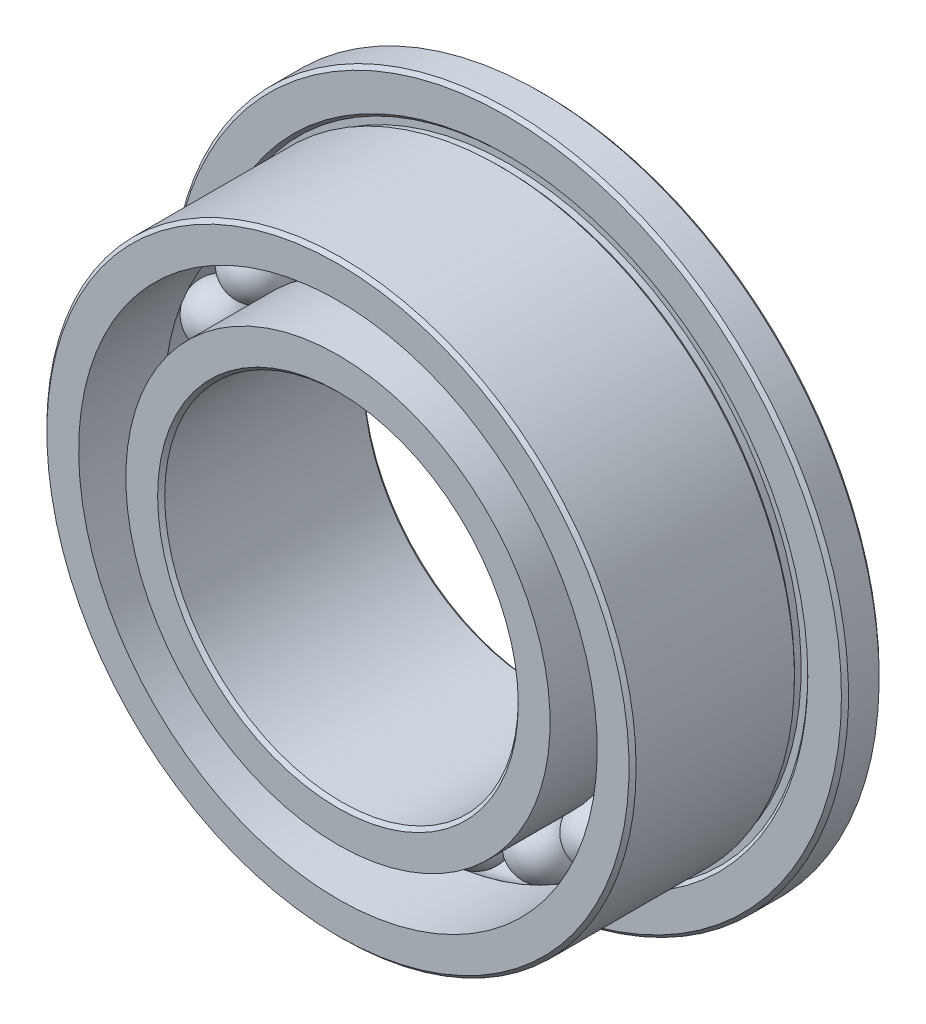
ISO-10303-21;
HEADER;
FILE_DESCRIPTION(('STEP AP214'),'2;1');
FILE_NAME('part.step','',(''),(''),'','','');
FILE_SCHEMA(('AUTOMOTIVE_DESIGN { 1 0 10303 214 1 1 1 1 }'));
ENDSEC;
DATA;
#1=APPLICATION_CONTEXT('core data for automotive mechanical design processes');
#2=APPLICATION_PROTOCOL_DEFINITION('international standard','automotive_design',2000,#1);
#3=PRODUCT_CONTEXT('',#1,'mechanical');
#4=PRODUCT('Part','Part','',(#3));
#5=PRODUCT_RELATED_PRODUCT_CATEGORY('part','',(#4));
#6=PRODUCT_DEFINITION_FORMATION('','',#4);
#7=PRODUCT_DEFINITION_CONTEXT('part definition',#1,'design');
#8=PRODUCT_DEFINITION('design','',#6,#7);
#9=PRODUCT_DEFINITION_SHAPE('','',#8);
#10=(LENGTH_UNIT() NAMED_UNIT(*) SI_UNIT(.MILLI.,.METRE.));
#11=(NAMED_UNIT(*) PLANE_ANGLE_UNIT() SI_UNIT($,.RADIAN.));
#12=(NAMED_UNIT(*) SI_UNIT($,.STERADIAN.) SOLID_ANGLE_UNIT());
#13=UNCERTAINTY_MEASURE_WITH_UNIT(LENGTH_MEASURE(1.E-05),#10,'distance_accuracy_value','');
#14=(GEOMETRIC_REPRESENTATION_CONTEXT(3) GLOBAL_UNCERTAINTY_ASSIGNED_CONTEXT((#13)) GLOBAL_UNIT_ASSIGNED_CONTEXT((#10,
#11,#12)) REPRESENTATION_CONTEXT('',''));
#15=CARTESIAN_POINT('',(0.,0.,0.));
#16=DIRECTION('',(0.,0.,1.));
#17=DIRECTION('',(1.,0.,0.));
#18=AXIS2_PLACEMENT_3D('',#15,#16,#17);
#19=CARTESIAN_POINT('',(-0.93584767875458,3.03394365837101,0.));
#20=DIRECTION('',(-0.294755174410891,0.955572805786145,0.));
#21=DIRECTION('',(0.955572805786145,0.294755174410891,0.));
#22=AXIS2_PLACEMENT_3D('',#19,#20,#21);
#23=SPHERICAL_SURFACE('',#22,0.396875);
#24=CARTESIAN_POINT('',(-1.0528286385989,3.41318661566739,0.));
#25=VERTEX_POINT('',#24);
#26=VERTEX_LOOP('',#25);
#27=FACE_BOUND('',#26,.T.);
#28=ADVANCED_FACE('F47',(#27),#23,.T.);
#29=CLOSED_SHELL('',(#28));
#30=MANIFOLD_SOLID_BREP('B2',#29);
#31=CARTESIAN_POINT('',(-1.78854118435197,2.62330810845331,0.));
#32=DIRECTION('',(-0.563320058063612,0.826238774316002,0.));
#33=DIRECTION('',(0.826238774316002,0.563320058063612,0.));
#34=AXIS2_PLACEMENT_3D('',#31,#32,#33);
#35=SPHERICAL_SURFACE('',#34,0.396875);
#36=CARTESIAN_POINT('',(-2.01210883239596,2.95122162200997,0.));
#37=VERTEX_POINT('',#36);
#38=VERTEX_LOOP('',#37);
#39=FACE_BOUND('',#38,.T.);
#40=ADVANCED_FACE('F65',(#39),#35,.T.);
#41=CLOSED_SHELL('',(#40));
#42=MANIFOLD_SOLID_BREP('B7',#41);
#43=CARTESIAN_POINT('',(-2.48231495683597,1.97958012090151,0.));
#44=DIRECTION('',(-0.781831482468022,0.623489801858743,0.));
#45=DIRECTION('',(0.623489801858743,0.781831482468022,0.));
#46=AXIS2_PLACEMENT_3D('',#43,#44,#45);
#47=SPHERICAL_SURFACE('',#46,0.396875);
#48=CARTESIAN_POINT('',(-2.79260432644047,2.2270276360142,0.));
#49=VERTEX_POINT('',#48);
#50=VERTEX_LOOP('',#49);
#51=FACE_BOUND('',#50,.T.);
#52=ADVANCED_FACE('F83',(#51),#47,.T.);
#53=CLOSED_SHELL('',(#52));
#54=MANIFOLD_SOLID_BREP('B43',#53);
#55=CARTESIAN_POINT('',(-2.95552415194534,1.15995775236334,0.));
#56=DIRECTION('',(-0.9308737486442,0.365341024366405,0.));
#57=DIRECTION('',(0.365341024366405,0.9308737486442,0.));
#58=AXIS2_PLACEMENT_3D('',#55,#56,#57);
#59=SPHERICAL_SURFACE('',#58,0.396875);
#60=CARTESIAN_POINT('',(-3.3249646709385,1.30495247140875,0.));
#61=VERTEX_POINT('',#60);
#62=VERTEX_LOOP('',#61);
#63=FACE_BOUND('',#62,.T.);
#64=ADVANCED_FACE('F101',(#63),#59,.T.);
#65=CLOSED_SHELL('',(#64));
#66=MANIFOLD_SOLID_BREP('B61',#65);
#67=CARTESIAN_POINT('',(-3.16612205605024,0.237268047136931,0.));
#68=DIRECTION('',(-0.997203797181179,0.0747300935864349,0.));
#69=DIRECTION('',(0.0747300935864349,0.997203797181179,0.));
#70=AXIS2_PLACEMENT_3D('',#67,#68,#69);
#71=SPHERICAL_SURFACE('',#70,0.396875);
#72=CARTESIAN_POINT('',(-3.56188731305653,0.266926553029047,0.));
#73=VERTEX_POINT('',#72);
#74=VERTEX_LOOP('',#73);
#75=FACE_BOUND('',#74,.T.);
#76=ADVANCED_FACE('F119',(#75),#71,.T.);
#77=CLOSED_SHELL('',(#76));
#78=MANIFOLD_SOLID_BREP('B79',#77);
#79=CARTESIAN_POINT('',(-3.0953961211773,-0.706503965311266,0.));
#80=DIRECTION('',(-0.974927912181826,-0.222520933956304,0.));
#81=DIRECTION('',(-0.222520933956304,0.974927912181826,0.));
#82=AXIS2_PLACEMENT_3D('',#79,#80,#81);
#83=SPHERICAL_SURFACE('',#82,0.396875);
#84=CARTESIAN_POINT('',(-3.48232063632446,-0.794816960975174,0.));
#85=VERTEX_POINT('',#84);
#86=VERTEX_LOOP('',#85);
#87=FACE_BOUND('',#86,.T.);
#88=ADVANCED_FACE('F137',(#87),#83,.T.);
#89=CLOSED_SHELL('',(#88));
#90=MANIFOLD_SOLID_BREP('B97',#89);
#91=CARTESIAN_POINT('',(-2.74963065701561,-1.58749999999997,0.));
#92=DIRECTION('',(-0.866025403784443,-0.499999999999992,0.));
#93=DIRECTION('',(-0.499999999999992,0.866025403784443,0.));
#94=AXIS2_PLACEMENT_3D('',#91,#92,#93);
#95=SPHERICAL_SURFACE('',#94,0.396875);
#96=CARTESIAN_POINT('',(-3.09333448914256,-1.78593749999997,0.));
#97=VERTEX_POINT('',#96);
#98=VERTEX_LOOP('',#97);
#99=FACE_BOUND('',#98,.T.);
#100=ADVANCED_FACE('F155',(#99),#95,.T.);
#101=CLOSED_SHELL('',(#100));
#102=MANIFOLD_SOLID_BREP('B115',#101);
#103=CARTESIAN_POINT('',(-2.15954844242269,-2.32743969305968,0.));
#104=DIRECTION('',(-0.680172737770926,-0.733051871829821,0.));
#105=DIRECTION('',(-0.733051871829821,0.680172737770926,0.));
#106=AXIS2_PLACEMENT_3D('',#103,#104,#105);
#107=SPHERICAL_SURFACE('',#106,0.396875);
#108=CARTESIAN_POINT('',(-2.42949199772553,-2.61836965469214,0.));
#109=VERTEX_POINT('',#108);
#110=VERTEX_LOOP('',#109);
#111=FACE_BOUND('',#110,.T.);
#112=ADVANCED_FACE('F173',(#111),#107,.T.);
#113=CLOSED_SHELL('',(#112));
#114=MANIFOLD_SOLID_BREP('B133',#113);
#115=CARTESIAN_POINT('',(-1.37758087169827,-2.86057615559017,0.));
#116=DIRECTION('',(-0.433883739117565,-0.900968867902416,0.));
#117=DIRECTION('',(-0.900968867902416,0.433883739117565,0.));
#118=AXIS2_PLACEMENT_3D('',#115,#116,#117);
#119=SPHERICAL_SURFACE('',#118,0.396875);
#120=CARTESIAN_POINT('',(-1.54977848066055,-3.21814817503894,0.));
#121=VERTEX_POINT('',#120);
#122=VERTEX_LOOP('',#121);
#123=FACE_BOUND('',#122,.T.);
#124=ADVANCED_FACE('F191',(#123),#119,.T.);
#125=CLOSED_SHELL('',(#124));
#126=MANIFOLD_SOLID_BREP('B151',#125);
#127=CARTESIAN_POINT('',(-0.473209195109378,-3.13953787326478,0.));
#128=DIRECTION('',(-0.149042266176182,-0.988830826225127,0.));
#129=DIRECTION('',(-0.988830826225127,0.149042266176182,0.));
#130=AXIS2_PLACEMENT_3D('',#127,#128,#129);
#131=SPHERICAL_SURFACE('',#130,0.396875);
#132=CARTESIAN_POINT('',(-0.53236034449805,-3.53198010742288,0.));
#133=VERTEX_POINT('',#132);
#134=VERTEX_LOOP('',#133);
#135=FACE_BOUND('',#134,.T.);
#136=ADVANCED_FACE('F209',(#135),#131,.T.);
#137=CLOSED_SHELL('',(#136));
#138=MANIFOLD_SOLID_BREP('B169',#137);
#139=CARTESIAN_POINT('',(0.473209195109333,-3.13953787326479,0.));
#140=DIRECTION('',(0.149042266176168,-0.98883082622513,0.));
#141=DIRECTION('',(-0.98883082622513,-0.149042266176168,0.));
#142=AXIS2_PLACEMENT_3D('',#139,#140,#141);
#143=SPHERICAL_SURFACE('',#142,0.396875);
#144=CARTESIAN_POINT('',(0.532360344497999,-3.53198010742289,0.));
#145=VERTEX_POINT('',#144);
#146=VERTEX_LOOP('',#145);
#147=FACE_BOUND('',#146,.T.);
#148=ADVANCED_FACE('F227',(#147),#143,.T.);
#149=CLOSED_SHELL('',(#148));
#150=MANIFOLD_SOLID_BREP('B187',#149);
#151=CARTESIAN_POINT('',(1.37758087169823,-2.86057615559019,0.));
#152=DIRECTION('',(0.433883739117553,-0.900968867902422,0.));
#153=DIRECTION('',(-0.900968867902422,-0.433883739117553,0.));
#154=AXIS2_PLACEMENT_3D('',#151,#152,#153);
#155=SPHERICAL_SURFACE('',#154,0.396875);
#156=CARTESIAN_POINT('',(1.54977848066051,-3.21814817503896,0.));
#157=VERTEX_POINT('',#156);
#158=VERTEX_LOOP('',#157);
#159=FACE_BOUND('',#158,.T.);
#160=ADVANCED_FACE('F245',(#159),#155,.T.);
#161=CLOSED_SHELL('',(#160));
#162=MANIFOLD_SOLID_BREP('B205',#161);
#163=CARTESIAN_POINT('',(2.15954844242266,-2.32743969305971,0.));
#164=DIRECTION('',(0.680172737770916,-0.73305187182983,0.));
#165=DIRECTION('',(-0.73305187182983,-0.680172737770916,0.));
#166=AXIS2_PLACEMENT_3D('',#163,#164,#165);
#167=SPHERICAL_SURFACE('',#166,0.396875);
#168=CARTESIAN_POINT('',(2.42949199772549,-2.61836965469217,0.));
#169=VERTEX_POINT('',#168);
#170=VERTEX_LOOP('',#169);
#171=FACE_BOUND('',#170,.T.);
#172=ADVANCED_FACE('F263',(#171),#167,.T.);
#173=CLOSED_SHELL('',(#172));
#174=MANIFOLD_SOLID_BREP('B223',#173);
#175=CARTESIAN_POINT('',(2.74963065701559,-1.58750000000001,0.));
#176=DIRECTION('',(0.866025403784437,-0.500000000000004,0.));
#177=DIRECTION('',(-0.500000000000004,-0.866025403784437,0.));
#178=AXIS2_PLACEMENT_3D('',#175,#176,#177);
#179=SPHERICAL_SURFACE('',#178,0.396875);
#180=CARTESIAN_POINT('',(3.09333448914253,-1.78593750000001,0.));
#181=VERTEX_POINT('',#180);
#182=VERTEX_LOOP('',#181);
#183=FACE_BOUND('',#182,.T.);
#184=ADVANCED_FACE('F281',(#183),#179,.T.);
#185=CLOSED_SHELL('',(#184));
#186=MANIFOLD_SOLID_BREP('B241',#185);
#187=CARTESIAN_POINT('',(3.09539612117729,-0.70650396531131,0.));
#188=DIRECTION('',(0.974927912181823,-0.222520933956318,0.));
#189=DIRECTION('',(-0.222520933956318,-0.974927912181823,0.));
#190=AXIS2_PLACEMENT_3D('',#187,#188,#189);
#191=SPHERICAL_SURFACE('',#190,0.396875);
#192=CARTESIAN_POINT('',(3.48232063632445,-0.794816960975224,0.));
#193=VERTEX_POINT('',#192);
#194=VERTEX_LOOP('',#193);
#195=FACE_BOUND('',#194,.T.);
#196=ADVANCED_FACE('F299',(#195),#191,.T.);
#197=CLOSED_SHELL('',(#196));
#198=MANIFOLD_SOLID_BREP('B259',#197);
#199=CARTESIAN_POINT('',(3.16612205605025,0.237268047136886,0.));
#200=DIRECTION('',(0.997203797181181,0.074730093586421,0.));
#201=DIRECTION('',(0.074730093586421,-0.997203797181181,0.));
#202=AXIS2_PLACEMENT_3D('',#199,#200,#201);
#203=SPHERICAL_SURFACE('',#202,0.396875);
#204=CARTESIAN_POINT('',(3.56188731305653,0.266926553028997,0.));
#205=VERTEX_POINT('',#204);
#206=VERTEX_LOOP('',#205);
#207=FACE_BOUND('',#206,.T.);
#208=ADVANCED_FACE('F317',(#207),#203,.T.);
#209=CLOSED_SHELL('',(#208));
#210=MANIFOLD_SOLID_BREP('B277',#209);
#211=CARTESIAN_POINT('',(2.95552415194535,1.1599577523633,0.));
#212=DIRECTION('',(0.930873748644205,0.365341024366393,0.));
#213=DIRECTION('',(0.365341024366393,-0.930873748644205,0.));
#214=AXIS2_PLACEMENT_3D('',#211,#212,#213);
#215=SPHERICAL_SURFACE('',#214,0.396875);
#216=CARTESIAN_POINT('',(3.32496467093852,1.30495247140871,0.));
#217=VERTEX_POINT('',#216);
#218=VERTEX_LOOP('',#217);
#219=FACE_BOUND('',#218,.T.);
#220=ADVANCED_FACE('F335',(#219),#215,.T.);
#221=CLOSED_SHELL('',(#220));
#222=MANIFOLD_SOLID_BREP('B295',#221);
#223=CARTESIAN_POINT('',(2.482314956836,1.97958012090147,0.));
#224=DIRECTION('',(0.781831482468031,0.623489801858732,0.));
#225=DIRECTION('',(0.623489801858732,-0.781831482468031,0.));
#226=AXIS2_PLACEMENT_3D('',#223,#224,#225);
#227=SPHERICAL_SURFACE('',#226,0.396875);
#228=CARTESIAN_POINT('',(2.7926043264405,2.22702763601416,0.));
#229=VERTEX_POINT('',#228);
#230=VERTEX_LOOP('',#229);
#231=FACE_BOUND('',#230,.T.);
#232=ADVANCED_FACE('F353',(#231),#227,.T.);
#233=CLOSED_SHELL('',(#232));
#234=MANIFOLD_SOLID_BREP('B313',#233);
#235=CARTESIAN_POINT('',(1.788541184352,2.62330810845328,0.));
#236=DIRECTION('',(0.563320058063623,0.826238774315994,0.));
#237=DIRECTION('',(0.826238774315994,-0.563320058063623,0.));
#238=AXIS2_PLACEMENT_3D('',#235,#236,#237);
#239=SPHERICAL_SURFACE('',#238,0.396875);
#240=CARTESIAN_POINT('',(2.012108832396,2.95122162200994,0.));
#241=VERTEX_POINT('',#240);
#242=VERTEX_LOOP('',#241);
#243=FACE_BOUND('',#242,.T.);
#244=ADVANCED_FACE('F371',(#243),#239,.T.);
#245=CLOSED_SHELL('',(#244));
#246=MANIFOLD_SOLID_BREP('B331',#245);
#247=CARTESIAN_POINT('',(0.935847678754623,3.033943658371,0.));
#248=DIRECTION('',(0.294755174410905,0.955572805786141,0.));
#249=DIRECTION('',(0.955572805786141,-0.294755174410905,0.));
#250=AXIS2_PLACEMENT_3D('',#247,#248,#249);
#251=SPHERICAL_SURFACE('',#250,0.396875);
#252=CARTESIAN_POINT('',(1.05282863859895,3.41318661566737,0.));
#253=VERTEX_POINT('',#252);
#254=VERTEX_LOOP('',#253);
#255=FACE_BOUND('',#254,.T.);
#256=ADVANCED_FACE('F389',(#255),#251,.T.);
#257=CLOSED_SHELL('',(#256));
#258=MANIFOLD_SOLID_BREP('B349',#257);
#259=CARTESIAN_POINT('',(0.,3.175,0.));
#260=DIRECTION('',(0.,1.,0.));
#261=DIRECTION('',(1.,0.,0.));
#262=AXIS2_PLACEMENT_3D('',#259,#260,#261);
#263=SPHERICAL_SURFACE('',#262,0.396875);
#264=CARTESIAN_POINT('',(0.,3.571875,0.));
#265=VERTEX_POINT('',#264);
#266=VERTEX_LOOP('',#265);
#267=FACE_BOUND('',#266,.T.);
#268=ADVANCED_FACE('F410',(#267),#263,.T.);
#269=CLOSED_SHELL('',(#268));
#270=MANIFOLD_SOLID_BREP('B367',#269);
#271=CARTESIAN_POINT('',(0.,0.,0.));
#272=DIRECTION('',(0.,0.,1.));
#273=DIRECTION('',(0.,-1.,0.));
#274=AXIS2_PLACEMENT_3D('',#271,#272,#273);
#275=CYLINDRICAL_SURFACE('',#274,2.8575);
#276=CARTESIAN_POINT('',(0.,0.,-0.238125000000001));
#277=DIRECTION('',(0.,0.,1.));
#278=DIRECTION('',(0.,-1.,0.));
#279=AXIS2_PLACEMENT_3D('',#276,#277,#278);
#280=CIRCLE('',#279,2.8575);
#281=CARTESIAN_POINT('',(0.,-2.8575,-0.238125000000001));
#282=VERTEX_POINT('',#281);
#283=EDGE_CURVE('E451',#282,#282,#280,.T.);
#284=ORIENTED_EDGE('',*,*,#283,.F.);
#285=EDGE_LOOP('',(#284));
#286=FACE_BOUND('',#285,.T.);
#287=CARTESIAN_POINT('',(0.,0.,-1.3890625));
#288=DIRECTION('',(0.,0.,1.));
#289=DIRECTION('',(0.,-1.,0.));
#290=AXIS2_PLACEMENT_3D('',#287,#288,#289);
#291=CIRCLE('',#290,2.8575);
#292=CARTESIAN_POINT('',(0.,-2.8575,-1.3890625));
#293=VERTEX_POINT('',#292);
#294=EDGE_CURVE('E460',#293,#293,#291,.T.);
#295=ORIENTED_EDGE('',*,*,#294,.T.);
#296=EDGE_LOOP('',(#295));
#297=FACE_BOUND('',#296,.T.);
#298=ADVANCED_FACE('F431',(#286,#297),#275,.T.);
#299=CARTESIAN_POINT('',(0.,0.,0.));
#300=DIRECTION('',(0.,0.,1.));
#301=DIRECTION('',(0.,-1.,0.));
#302=AXIS2_PLACEMENT_3D('',#299,#300,#301);
#303=TOROIDAL_SURFACE('',#302,3.175,0.396875);
#304=CARTESIAN_POINT('',(0.,0.,0.238125));
#305=DIRECTION('',(0.,0.,1.));
#306=DIRECTION('',(0.,-1.,0.));
#307=AXIS2_PLACEMENT_3D('',#304,#305,#306);
#308=CIRCLE('',#307,2.8575);
#309=CARTESIAN_POINT('',(0.,-2.8575,0.238125));
#310=VERTEX_POINT('',#309);
#311=EDGE_CURVE('E454',#310,#310,#308,.T.);
#312=ORIENTED_EDGE('',*,*,#311,.F.);
#313=EDGE_LOOP('',(#312));
#314=FACE_BOUND('',#313,.T.);
#315=ORIENTED_EDGE('',*,*,#283,.T.);
#316=EDGE_LOOP('',(#315));
#317=FACE_BOUND('',#316,.T.);
#318=ADVANCED_FACE('F479',(#314,#317),#303,.F.);
#319=CARTESIAN_POINT('',(0.,0.,0.));
#320=DIRECTION('',(0.,0.,1.));
#321=DIRECTION('',(0.,-1.,0.));
#322=AXIS2_PLACEMENT_3D('',#319,#320,#321);
#323=CYLINDRICAL_SURFACE('',#322,2.8575);
#324=CARTESIAN_POINT('',(0.,0.,1.3890625));
#325=DIRECTION('',(0.,0.,1.));
#326=DIRECTION('',(0.,-1.,0.));
#327=AXIS2_PLACEMENT_3D('',#324,#325,#326);
#328=CIRCLE('',#327,2.8575);
#329=CARTESIAN_POINT('',(0.,-2.8575,1.3890625));
#330=VERTEX_POINT('',#329);
#331=EDGE_CURVE('E457',#330,#330,#328,.T.);
#332=ORIENTED_EDGE('',*,*,#331,.F.);
#333=EDGE_LOOP('',(#332));
#334=FACE_BOUND('',#333,.T.);
#335=ORIENTED_EDGE('',*,*,#311,.T.);
#336=EDGE_LOOP('',(#335));
#337=FACE_BOUND('',#336,.T.);
#338=ADVANCED_FACE('F485',(#334,#337),#323,.T.);
#339=CARTESIAN_POINT('',(0.,2.38125,1.3890625));
#340=DIRECTION('',(0.,0.,-1.));
#341=DIRECTION('',(0.,1.,0.));
#342=AXIS2_PLACEMENT_3D('',#339,#340,#341);
#343=PLANE('',#342);
#344=CARTESIAN_POINT('',(0.,0.,1.3890625));
#345=DIRECTION('',(0.,0.,-1.));
#346=DIRECTION('',(0.,1.,0.));
#347=AXIS2_PLACEMENT_3D('',#344,#345,#346);
#348=CIRCLE('',#347,2.428875);
#349=CARTESIAN_POINT('',(0.,2.428875,1.3890625));
#350=VERTEX_POINT('',#349);
#351=EDGE_CURVE('E409',#350,#350,#348,.T.);
#352=ORIENTED_EDGE('',*,*,#351,.T.);
#353=EDGE_LOOP('',(#352));
#354=FACE_BOUND('',#353,.T.);
#355=ORIENTED_EDGE('',*,*,#331,.T.);
#356=EDGE_LOOP('',(#355));
#357=FACE_BOUND('',#356,.T.);
#358=ADVANCED_FACE('F476',(#354,#357),#343,.F.);
#359=CARTESIAN_POINT('',(0.,0.,0.));
#360=DIRECTION('',(0.,0.,1.));
#361=DIRECTION('',(0.,-1.,0.));
#362=AXIS2_PLACEMENT_3D('',#359,#360,#361);
#363=CYLINDRICAL_SURFACE('',#362,2.38125);
#364=CARTESIAN_POINT('',(0.,0.,-1.3414375));
#365=DIRECTION('',(0.,0.,1.));
#366=DIRECTION('',(0.,-1.,0.));
#367=AXIS2_PLACEMENT_3D('',#364,#365,#366);
#368=CIRCLE('',#367,2.38125);
#369=CARTESIAN_POINT('',(0.,-2.38125,-1.3414375));
#370=VERTEX_POINT('',#369);
#371=EDGE_CURVE('E438',#370,#370,#368,.F.);
#372=ORIENTED_EDGE('',*,*,#371,.T.);
#373=EDGE_LOOP('',(#372));
#374=FACE_BOUND('',#373,.T.);
#375=CARTESIAN_POINT('',(0.,0.,1.3414375));
#376=DIRECTION('',(0.,0.,-1.));
#377=DIRECTION('',(0.,1.,0.));
#378=AXIS2_PLACEMENT_3D('',#375,#376,#377);
#379=CIRCLE('',#378,2.38125);
#380=CARTESIAN_POINT('',(0.,2.38125,1.3414375));
#381=VERTEX_POINT('',#380);
#382=EDGE_CURVE('E442',#381,#381,#379,.F.);
#383=ORIENTED_EDGE('',*,*,#382,.T.);
#384=EDGE_LOOP('',(#383));
#385=FACE_BOUND('',#384,.T.);
#386=ADVANCED_FACE('F468',(#374,#385),#363,.F.);
#387=CARTESIAN_POINT('',(0.,2.8575,-1.3890625));
#388=DIRECTION('',(0.,0.,1.));
#389=DIRECTION('',(0.,-1.,0.));
#390=AXIS2_PLACEMENT_3D('',#387,#388,#389);
#391=PLANE('',#390);
#392=CARTESIAN_POINT('',(0.,0.,-1.3890625));
#393=DIRECTION('',(0.,0.,1.));
#394=DIRECTION('',(0.,-1.,0.));
#395=AXIS2_PLACEMENT_3D('',#392,#393,#394);
#396=CIRCLE('',#395,2.428875);
#397=CARTESIAN_POINT('',(0.,-2.428875,-1.3890625));
#398=VERTEX_POINT('',#397);
#399=EDGE_CURVE('E446',#398,#398,#396,.T.);
#400=ORIENTED_EDGE('',*,*,#399,.T.);
#401=EDGE_LOOP('',(#400));
#402=FACE_BOUND('',#401,.T.);
#403=ORIENTED_EDGE('',*,*,#294,.F.);
#404=EDGE_LOOP('',(#403));
#405=FACE_BOUND('',#404,.T.);
#406=ADVANCED_FACE('F465',(#402,#405),#391,.F.);
#407=CARTESIAN_POINT('',(0.,0.,-1.3890625));
#408=DIRECTION('',(0.,0.,-1.));
#409=DIRECTION('',(0.,1.,0.));
#410=AXIS2_PLACEMENT_3D('',#407,#408,#409);
#411=CONICAL_SURFACE('',#410,2.428875,0.785398163397448);
#412=ORIENTED_EDGE('',*,*,#371,.F.);
#413=EDGE_LOOP('',(#412));
#414=FACE_BOUND('',#413,.T.);
#415=ORIENTED_EDGE('',*,*,#399,.F.);
#416=EDGE_LOOP('',(#415));
#417=FACE_BOUND('',#416,.T.);
#418=ADVANCED_FACE('F467',(#414,#417),#411,.F.);
#419=CARTESIAN_POINT('',(0.,0.,1.3414375));
#420=DIRECTION('',(0.,0.,1.));
#421=DIRECTION('',(0.,-1.,0.));
#422=AXIS2_PLACEMENT_3D('',#419,#420,#421);
#423=CONICAL_SURFACE('',#422,2.38125,0.785398163397448);
#424=ORIENTED_EDGE('',*,*,#351,.F.);
#425=EDGE_LOOP('',(#424));
#426=FACE_BOUND('',#425,.T.);
#427=ORIENTED_EDGE('',*,*,#382,.F.);
#428=EDGE_LOOP('',(#427));
#429=FACE_BOUND('',#428,.T.);
#430=ADVANCED_FACE('F433',(#426,#429),#423,.F.);
#431=CLOSED_SHELL('',(#298,#318,#338,#358,#386,#406,#418,#430));
#432=MANIFOLD_SOLID_BREP('B385',#431);
#433=CARTESIAN_POINT('',(0.,3.4925,-1.3890625));
#434=DIRECTION('',(0.,0.,1.));
#435=DIRECTION('',(0.,-1.,0.));
#436=AXIS2_PLACEMENT_3D('',#433,#434,#435);
#437=PLANE('',#436);
#438=CARTESIAN_POINT('',(0.,0.,-1.3890625));
#439=DIRECTION('',(0.,0.,1.));
#440=DIRECTION('',(0.,-1.,0.));
#441=AXIS2_PLACEMENT_3D('',#438,#439,#440);
#442=CIRCLE('',#441,4.511675);
#443=CARTESIAN_POINT('',(0.,-4.511675,-1.3890625));
#444=VERTEX_POINT('',#443);
#445=EDGE_CURVE('E571',#444,#444,#442,.F.);
#446=ORIENTED_EDGE('',*,*,#445,.T.);
#447=EDGE_LOOP('',(#446));
#448=FACE_BOUND('',#447,.T.);
#449=CARTESIAN_POINT('',(0.,0.,-1.3890625));
#450=DIRECTION('',(0.,0.,1.));
#451=DIRECTION('',(0.,-1.,0.));
#452=AXIS2_PLACEMENT_3D('',#449,#450,#451);
#453=CIRCLE('',#452,3.4925);
#454=CARTESIAN_POINT('',(0.,-3.4925,-1.3890625));
#455=VERTEX_POINT('',#454);
#456=EDGE_CURVE('E585',#455,#455,#453,.T.);
#457=ORIENTED_EDGE('',*,*,#456,.T.);
#458=EDGE_LOOP('',(#457));
#459=FACE_BOUND('',#458,.T.);
#460=ADVANCED_FACE('F553',(#448,#459),#437,.F.);
#461=CARTESIAN_POINT('',(0.,0.,0.));
#462=DIRECTION('',(0.,0.,1.));
#463=DIRECTION('',(0.,-1.,0.));
#464=AXIS2_PLACEMENT_3D('',#461,#462,#463);
#465=CYLINDRICAL_SURFACE('',#464,3.4925);
#466=ORIENTED_EDGE('',*,*,#456,.F.);
#467=EDGE_LOOP('',(#466));
#468=FACE_BOUND('',#467,.T.);
#469=CARTESIAN_POINT('',(0.,0.,-0.238125000000001));
#470=DIRECTION('',(0.,0.,1.));
#471=DIRECTION('',(0.,-1.,0.));
#472=AXIS2_PLACEMENT_3D('',#469,#470,#471);
#473=CIRCLE('',#472,3.4925);
#474=CARTESIAN_POINT('',(0.,-3.4925,-0.238125000000001));
#475=VERTEX_POINT('',#474);
#476=EDGE_CURVE('E589',#475,#475,#473,.T.);
#477=ORIENTED_EDGE('',*,*,#476,.T.);
#478=EDGE_LOOP('',(#477));
#479=FACE_BOUND('',#478,.T.);
#480=ADVANCED_FACE('F640',(#468,#479),#465,.F.);
#481=CARTESIAN_POINT('',(0.,0.,0.));
#482=DIRECTION('',(0.,0.,1.));
#483=DIRECTION('',(0.,-1.,0.));
#484=AXIS2_PLACEMENT_3D('',#481,#482,#483);
#485=TOROIDAL_SURFACE('',#484,3.175,0.396875);
#486=ORIENTED_EDGE('',*,*,#476,.F.);
#487=EDGE_LOOP('',(#486));
#488=FACE_BOUND('',#487,.T.);
#489=CARTESIAN_POINT('',(0.,0.,0.238125));
#490=DIRECTION('',(0.,0.,1.));
#491=DIRECTION('',(0.,-1.,0.));
#492=AXIS2_PLACEMENT_3D('',#489,#490,#491);
#493=CIRCLE('',#492,3.4925);
#494=CARTESIAN_POINT('',(0.,-3.4925,0.238125));
#495=VERTEX_POINT('',#494);
#496=EDGE_CURVE('E593',#495,#495,#493,.T.);
#497=ORIENTED_EDGE('',*,*,#496,.T.);
#498=EDGE_LOOP('',(#497));
#499=FACE_BOUND('',#498,.T.);
#500=ADVANCED_FACE('F646',(#488,#499),#485,.F.);
#501=CARTESIAN_POINT('',(0.,0.,0.));
#502=DIRECTION('',(0.,0.,1.));
#503=DIRECTION('',(0.,-1.,0.));
#504=AXIS2_PLACEMENT_3D('',#501,#502,#503);
#505=CYLINDRICAL_SURFACE('',#504,3.4925);
#506=ORIENTED_EDGE('',*,*,#496,.F.);
#507=EDGE_LOOP('',(#506));
#508=FACE_BOUND('',#507,.T.);
#509=CARTESIAN_POINT('',(0.,0.,1.3890625));
#510=DIRECTION('',(0.,0.,1.));
#511=DIRECTION('',(0.,-1.,0.));
#512=AXIS2_PLACEMENT_3D('',#509,#510,#511);
#513=CIRCLE('',#512,3.4925);
#514=CARTESIAN_POINT('',(0.,-3.4925,1.3890625));
#515=VERTEX_POINT('',#514);
#516=EDGE_CURVE('E597',#515,#515,#513,.T.);
#517=ORIENTED_EDGE('',*,*,#516,.T.);
#518=EDGE_LOOP('',(#517));
#519=FACE_BOUND('',#518,.T.);
#520=ADVANCED_FACE('F710',(#508,#519),#505,.F.);
#521=CARTESIAN_POINT('',(0.,3.96875,1.3890625));
#522=DIRECTION('',(0.,0.,-1.));
#523=DIRECTION('',(0.,1.,0.));
#524=AXIS2_PLACEMENT_3D('',#521,#522,#523);
#525=PLANE('',#524);
#526=CARTESIAN_POINT('',(0.,0.,1.3890625));
#527=DIRECTION('',(0.,0.,-1.));
#528=DIRECTION('',(0.,1.,0.));
#529=AXIS2_PLACEMENT_3D('',#526,#527,#528);
#530=CIRCLE('',#529,3.921125);
#531=CARTESIAN_POINT('',(0.,3.921125,1.3890625));
#532=VERTEX_POINT('',#531);
#533=EDGE_CURVE('E561',#532,#532,#530,.F.);
#534=ORIENTED_EDGE('',*,*,#533,.T.);
#535=EDGE_LOOP('',(#534));
#536=FACE_BOUND('',#535,.T.);
#537=ORIENTED_EDGE('',*,*,#516,.F.);
#538=EDGE_LOOP('',(#537));
#539=FACE_BOUND('',#538,.T.);
#540=ADVANCED_FACE('F700',(#536,#539),#525,.F.);
#541=CARTESIAN_POINT('',(0.,0.,0.));
#542=DIRECTION('',(0.,0.,1.));
#543=DIRECTION('',(0.,-1.,0.));
#544=AXIS2_PLACEMENT_3D('',#541,#542,#543);
#545=CYLINDRICAL_SURFACE('',#544,3.96875);
#546=CARTESIAN_POINT('',(0.,0.,1.3414375));
#547=DIRECTION('',(0.,0.,-1.));
#548=DIRECTION('',(0.,1.,0.));
#549=AXIS2_PLACEMENT_3D('',#546,#547,#548);
#550=CIRCLE('',#549,3.96875);
#551=CARTESIAN_POINT('',(0.,3.96875,1.3414375));
#552=VERTEX_POINT('',#551);
#553=EDGE_CURVE('E430',#552,#552,#550,.T.);
#554=ORIENTED_EDGE('',*,*,#553,.T.);
#555=EDGE_LOOP('',(#554));
#556=FACE_BOUND('',#555,.T.);
#557=CARTESIAN_POINT('',(0.,0.,-0.791259938789308));
#558=DIRECTION('',(0.,0.,1.));
#559=DIRECTION('',(0.,-1.,0.));
#560=AXIS2_PLACEMENT_3D('',#557,#558,#559);
#561=CIRCLE('',#560,3.96875);
#562=CARTESIAN_POINT('',(0.,-3.96875,-0.791259938789308));
#563=VERTEX_POINT('',#562);
#564=EDGE_CURVE('E601',#563,#563,#561,.T.);
#565=ORIENTED_EDGE('',*,*,#564,.T.);
#566=EDGE_LOOP('',(#565));
#567=FACE_BOUND('',#566,.T.);
#568=ADVANCED_FACE('F694',(#556,#567),#545,.T.);
#569=CARTESIAN_POINT('',(0.,0.,-0.836161219394655));
#570=DIRECTION('',(0.,0.,1.));
#571=DIRECTION('',(0.,-1.,0.));
#572=AXIS2_PLACEMENT_3D('',#569,#570,#571);
#573=CONICAL_SURFACE('',#572,3.92384871939465,0.785398163397457);
#574=ORIENTED_EDGE('',*,*,#564,.F.);
#575=EDGE_LOOP('',(#574));
#576=FACE_BOUND('',#575,.T.);
#577=CARTESIAN_POINT('',(0.,0.,-0.836161219394655));
#578=DIRECTION('',(0.,0.,1.));
#579=DIRECTION('',(0.,-1.,0.));
#580=AXIS2_PLACEMENT_3D('',#577,#578,#579);
#581=CIRCLE('',#580,3.92384871939465);
#582=CARTESIAN_POINT('',(0.,-3.92384871939465,-0.836161219394655));
#583=VERTEX_POINT('',#582);
#584=EDGE_CURVE('E605',#583,#583,#581,.T.);
#585=ORIENTED_EDGE('',*,*,#584,.T.);
#586=EDGE_LOOP('',(#585));
#587=FACE_BOUND('',#586,.T.);
#588=ADVANCED_FACE('F699',(#576,#587),#573,.T.);
#589=CARTESIAN_POINT('',(0.,0.,0.));
#590=DIRECTION('',(0.,0.,1.));
#591=DIRECTION('',(0.,-1.,0.));
#592=AXIS2_PLACEMENT_3D('',#589,#590,#591);
#593=CYLINDRICAL_SURFACE('',#592,3.92384871939465);
#594=ORIENTED_EDGE('',*,*,#584,.F.);
#595=EDGE_LOOP('',(#594));
#596=FACE_BOUND('',#595,.T.);
#597=CARTESIAN_POINT('',(0.,0.,-0.925963780605347));
#598=DIRECTION('',(0.,0.,1.));
#599=DIRECTION('',(0.,-1.,0.));
#600=AXIS2_PLACEMENT_3D('',#597,#598,#599);
#601=CIRCLE('',#600,3.92384871939465);
#602=CARTESIAN_POINT('',(0.,-3.92384871939465,-0.925963780605347));
#603=VERTEX_POINT('',#602);
#604=EDGE_CURVE('E609',#603,#603,#601,.T.);
#605=ORIENTED_EDGE('',*,*,#604,.T.);
#606=EDGE_LOOP('',(#605));
#607=FACE_BOUND('',#606,.T.);
#608=ADVANCED_FACE('F732',(#596,#607),#593,.T.);
#609=CARTESIAN_POINT('',(0.,4.01365128060534,-0.925963780605347));
#610=DIRECTION('',(0.,0.,-1.));
#611=DIRECTION('',(0.,1.,0.));
#612=AXIS2_PLACEMENT_3D('',#609,#610,#611);
#613=PLANE('',#612);
#614=ORIENTED_EDGE('',*,*,#604,.F.);
#615=EDGE_LOOP('',(#614));
#616=FACE_BOUND('',#615,.T.);
#617=CARTESIAN_POINT('',(0.,0.,-0.925963780605347));
#618=DIRECTION('',(0.,0.,1.));
#619=DIRECTION('',(0.,-1.,0.));
#620=AXIS2_PLACEMENT_3D('',#617,#618,#619);
#621=CIRCLE('',#620,4.01365128060534);
#622=CARTESIAN_POINT('',(0.,-4.01365128060534,-0.925963780605347));
#623=VERTEX_POINT('',#622);
#624=EDGE_CURVE('E613',#623,#623,#621,.T.);
#625=ORIENTED_EDGE('',*,*,#624,.T.);
#626=EDGE_LOOP('',(#625));
#627=FACE_BOUND('',#626,.T.);
#628=ADVANCED_FACE('F636',(#616,#627),#613,.F.);
#629=CARTESIAN_POINT('',(0.,0.,-0.881062500000001));
#630=DIRECTION('',(0.,0.,1.));
#631=DIRECTION('',(0.,-1.,0.));
#632=AXIS2_PLACEMENT_3D('',#629,#630,#631);
#633=CONICAL_SURFACE('',#632,4.05855256121069,0.785398163397435);
#634=ORIENTED_EDGE('',*,*,#624,.F.);
#635=EDGE_LOOP('',(#634));
#636=FACE_BOUND('',#635,.T.);
#637=CARTESIAN_POINT('',(0.,0.,-0.881062500000001));
#638=DIRECTION('',(0.,0.,1.));
#639=DIRECTION('',(0.,-1.,0.));
#640=AXIS2_PLACEMENT_3D('',#637,#638,#639);
#641=CIRCLE('',#640,4.05855256121069);
#642=CARTESIAN_POINT('',(0.,-4.05855256121069,-0.881062500000001));
#643=VERTEX_POINT('',#642);
#644=EDGE_CURVE('E617',#643,#643,#641,.T.);
#645=ORIENTED_EDGE('',*,*,#644,.T.);
#646=EDGE_LOOP('',(#645));
#647=FACE_BOUND('',#646,.T.);
#648=ADVANCED_FACE('F622',(#636,#647),#633,.F.);
#649=CARTESIAN_POINT('',(0.,4.5593,-0.8810625));
#650=DIRECTION('',(0.,0.,-1.));
#651=DIRECTION('',(0.,1.,0.));
#652=AXIS2_PLACEMENT_3D('',#649,#650,#651);
#653=PLANE('',#652);
#654=CARTESIAN_POINT('',(0.,0.,-0.881062500000001));
#655=DIRECTION('',(0.,0.,-1.));
#656=DIRECTION('',(0.,1.,0.));
#657=AXIS2_PLACEMENT_3D('',#654,#655,#656);
#658=CIRCLE('',#657,4.511675);
#659=CARTESIAN_POINT('',(0.,4.511675,-0.8810625));
#660=VERTEX_POINT('',#659);
#661=EDGE_CURVE('E566',#660,#660,#658,.F.);
#662=ORIENTED_EDGE('',*,*,#661,.T.);
#663=EDGE_LOOP('',(#662));
#664=FACE_BOUND('',#663,.T.);
#665=ORIENTED_EDGE('',*,*,#644,.F.);
#666=EDGE_LOOP('',(#665));
#667=FACE_BOUND('',#666,.T.);
#668=ADVANCED_FACE('F624',(#664,#667),#653,.F.);
#669=CARTESIAN_POINT('',(0.,0.,0.));
#670=DIRECTION('',(0.,0.,1.));
#671=DIRECTION('',(0.,-1.,0.));
#672=AXIS2_PLACEMENT_3D('',#669,#670,#671);
#673=CYLINDRICAL_SURFACE('',#672,4.5593);
#674=CARTESIAN_POINT('',(0.,0.,-1.3414375));
#675=DIRECTION('',(0.,0.,1.));
#676=DIRECTION('',(0.,-1.,0.));
#677=AXIS2_PLACEMENT_3D('',#674,#675,#676);
#678=CIRCLE('',#677,4.5593);
#679=CARTESIAN_POINT('',(0.,-4.5593,-1.3414375));
#680=VERTEX_POINT('',#679);
#681=EDGE_CURVE('E577',#680,#680,#678,.T.);
#682=ORIENTED_EDGE('',*,*,#681,.T.);
#683=EDGE_LOOP('',(#682));
#684=FACE_BOUND('',#683,.T.);
#685=CARTESIAN_POINT('',(0.,0.,-0.928687500000001));
#686=DIRECTION('',(0.,0.,-1.));
#687=DIRECTION('',(0.,1.,0.));
#688=AXIS2_PLACEMENT_3D('',#685,#686,#687);
#689=CIRCLE('',#688,4.5593);
#690=CARTESIAN_POINT('',(0.,4.5593,-0.9286875));
#691=VERTEX_POINT('',#690);
#692=EDGE_CURVE('E581',#691,#691,#689,.T.);
#693=ORIENTED_EDGE('',*,*,#692,.T.);
#694=EDGE_LOOP('',(#693));
#695=FACE_BOUND('',#694,.T.);
#696=ADVANCED_FACE('F626',(#684,#695),#673,.T.);
#697=CARTESIAN_POINT('',(0.,0.,-1.3414375));
#698=DIRECTION('',(0.,0.,1.));
#699=DIRECTION('',(0.,-1.,0.));
#700=AXIS2_PLACEMENT_3D('',#697,#698,#699);
#701=CONICAL_SURFACE('',#700,4.5593,0.785398163397448);
#702=ORIENTED_EDGE('',*,*,#445,.F.);
#703=EDGE_LOOP('',(#702));
#704=FACE_BOUND('',#703,.T.);
#705=ORIENTED_EDGE('',*,*,#681,.F.);
#706=EDGE_LOOP('',(#705));
#707=FACE_BOUND('',#706,.T.);
#708=ADVANCED_FACE('F633',(#704,#707),#701,.T.);
#709=CARTESIAN_POINT('',(0.,0.,-0.881062500000001));
#710=DIRECTION('',(0.,0.,-1.));
#711=DIRECTION('',(0.,1.,0.));
#712=AXIS2_PLACEMENT_3D('',#709,#710,#711);
#713=CONICAL_SURFACE('',#712,4.511675,0.785398163397447);
#714=CARTESIAN_POINT('',(0.,4.5593,-0.9286875));
#715=CARTESIAN_POINT('',(0.,4.55880390625,-0.92819140625));
#716=CARTESIAN_POINT('',(0.,4.5583078125,-0.9276953125));
#717=CARTESIAN_POINT('',(0.,4.557315625,-0.926703125));
#718=CARTESIAN_POINT('',(0.,4.55681953125,-0.92620703125));
#719=CARTESIAN_POINT('',(0.,4.55582734375,-0.92521484375));
#720=CARTESIAN_POINT('',(0.,4.55533125,-0.92471875));
#721=CARTESIAN_POINT('',(0.,4.5543390625,-0.9237265625));
#722=CARTESIAN_POINT('',(0.,4.55384296875,-0.92323046875));
#723=CARTESIAN_POINT('',(0.,4.55285078125,-0.92223828125));
#724=CARTESIAN_POINT('',(0.,4.5523546875,-0.9217421875));
#725=CARTESIAN_POINT('',(0.,4.5513625,-0.92075));
#726=CARTESIAN_POINT('',(0.,4.55086640625,-0.92025390625));
#727=CARTESIAN_POINT('',(0.,4.54987421875,-0.91926171875));
#728=CARTESIAN_POINT('',(0.,4.549378125,-0.918765625));
#729=CARTESIAN_POINT('',(0.,4.5483859375,-0.9177734375));
#730=CARTESIAN_POINT('',(0.,4.54788984375,-0.91727734375));
#731=CARTESIAN_POINT('',(0.,4.54689765625,-0.91628515625));
#732=CARTESIAN_POINT('',(0.,4.5464015625,-0.9157890625));
#733=CARTESIAN_POINT('',(0.,4.545409375,-0.914796875));
#734=CARTESIAN_POINT('',(0.,4.54491328125,-0.91430078125));
#735=CARTESIAN_POINT('',(0.,4.54392109375,-0.91330859375));
#736=CARTESIAN_POINT('',(0.,4.543425,-0.9128125));
#737=CARTESIAN_POINT('',(0.,4.5424328125,-0.9118203125));
#738=CARTESIAN_POINT('',(0.,4.54193671875,-0.91132421875));
#739=CARTESIAN_POINT('',(0.,4.54094453125,-0.91033203125));
#740=CARTESIAN_POINT('',(0.,4.5404484375,-0.9098359375));
#741=CARTESIAN_POINT('',(0.,4.53945625,-0.90884375));
#742=CARTESIAN_POINT('',(0.,4.53896015625,-0.90834765625));
#743=CARTESIAN_POINT('',(0.,4.53796796875,-0.90735546875));
#744=CARTESIAN_POINT('',(0.,4.537471875,-0.906859375));
#745=CARTESIAN_POINT('',(0.,4.5364796875,-0.9058671875));
#746=CARTESIAN_POINT('',(0.,4.53598359375,-0.90537109375));
#747=CARTESIAN_POINT('',(0.,4.53499140625,-0.904378906250001));
#748=CARTESIAN_POINT('',(0.,4.5344953125,-0.9038828125));
#749=CARTESIAN_POINT('',(0.,4.533503125,-0.902890625));
#750=CARTESIAN_POINT('',(0.,4.53300703125,-0.90239453125));
#751=CARTESIAN_POINT('',(0.,4.53201484375,-0.90140234375));
#752=CARTESIAN_POINT('',(0.,4.53151875,-0.90090625));
#753=CARTESIAN_POINT('',(0.,4.5305265625,-0.8999140625));
#754=CARTESIAN_POINT('',(0.,4.53003046875,-0.89941796875));
#755=CARTESIAN_POINT('',(0.,4.52903828125,-0.89842578125));
#756=CARTESIAN_POINT('',(0.,4.5285421875,-0.8979296875));
#757=CARTESIAN_POINT('',(0.,4.52755,-0.8969375));
#758=CARTESIAN_POINT('',(0.,4.52705390625,-0.89644140625));
#759=CARTESIAN_POINT('',(0.,4.52606171875,-0.89544921875));
#760=CARTESIAN_POINT('',(0.,4.525565625,-0.894953125));
#761=CARTESIAN_POINT('',(0.,4.5245734375,-0.8939609375));
#762=CARTESIAN_POINT('',(0.,4.52407734375,-0.89346484375));
#763=CARTESIAN_POINT('',(0.,4.52308515625,-0.89247265625));
#764=CARTESIAN_POINT('',(0.,4.5225890625,-0.8919765625));
#765=CARTESIAN_POINT('',(0.,4.521596875,-0.890984375));
#766=CARTESIAN_POINT('',(0.,4.52110078125,-0.89048828125));
#767=CARTESIAN_POINT('',(0.,4.52010859375,-0.88949609375));
#768=CARTESIAN_POINT('',(0.,4.5196125,-0.889));
#769=CARTESIAN_POINT('',(0.,4.5186203125,-0.8880078125));
#770=CARTESIAN_POINT('',(0.,4.51812421875,-0.88751171875));
#771=CARTESIAN_POINT('',(0.,4.51713203125,-0.88651953125));
#772=CARTESIAN_POINT('',(0.,4.5166359375,-0.8860234375));
#773=CARTESIAN_POINT('',(0.,4.51564375,-0.88503125));
#774=CARTESIAN_POINT('',(0.,4.51514765625,-0.88453515625));
#775=CARTESIAN_POINT('',(0.,4.51415546875,-0.88354296875));
#776=CARTESIAN_POINT('',(0.,4.513659375,-0.883046875));
#777=CARTESIAN_POINT('',(0.,4.5126671875,-0.8820546875));
#778=CARTESIAN_POINT('',(0.,4.51217109375,-0.88155859375));
#779=CARTESIAN_POINT('',(0.,4.511675,-0.8810625));
#780=B_SPLINE_CURVE_WITH_KNOTS('',3,(#714,#715,#716,#717,#718,#719,#720,#721,#722,#723,#724,
#725,#726,#727,#728,#729,#730,#731,#732,#733,#734,#735,#736,#737,#738,#739,#740,#741,#742,#743,
#744,#745,#746,#747,#748,#749,#750,#751,#752,#753,#754,#755,#756,#757,#758,#759,#760,#761,#762,
#763,#764,#765,#766,#767,#768,#769,#770,#771,#772,#773,#774,#775,#776,#777,#778,#779),
.UNSPECIFIED.,.F.,.F.,(4,2,2,2,2,2,2,2,2,2,2,2,2,2,2,2,2,2,2,2,2,2,2,2,2,2,2,2,2,2,2,2,4),(0.,
0.00210474752837554,0.00420949505675101,0.00631424258512708,0.00841899011350263,
0.0105237376418781,0.0126284851702536,0.014733232698629,0.0168379802270046,0.01894272775538,
0.0210474752837561,0.0231522228121316,0.0252569703405071,0.0273617178688826,0.029466465397258,
0.0315712129256336,0.0336759604540097,0.0357807079823851,0.0378854555107607,0.0399902030391361,
0.0420949505675116,0.0441996980958871,0.0463044456242626,0.0484091931526387,0.0505139406810141,
0.0526186882093897,0.0547234357377651,0.0568281832661406,0.0589329307945161,0.0610376783228922,
0.0631424258512677,0.0652471733796432,0.0673519209080186),.UNSPECIFIED.);
#781=EDGE_CURVE('BSEAM653',#691,#660,#780,.T.);
#782=ORIENTED_EDGE('',*,*,#692,.F.);
#783=ORIENTED_EDGE('',*,*,#661,.F.);
#784=ORIENTED_EDGE('',*,*,#781,.T.);
#785=ORIENTED_EDGE('',*,*,#781,.F.);
#786=EDGE_LOOP('',(#782,#784,#783,#785));
#787=FACE_BOUND('',#786,.T.);
#788=ADVANCED_FACE('F653',(#787),#713,.T.);
#789=CARTESIAN_POINT('',(0.,0.,1.3890625));
#790=DIRECTION('',(0.,0.,-1.));
#791=DIRECTION('',(0.,1.,0.));
#792=AXIS2_PLACEMENT_3D('',#789,#790,#791);
#793=CONICAL_SURFACE('',#792,3.921125,0.785398163397448);
#794=ORIENTED_EDGE('',*,*,#553,.F.);
#795=EDGE_LOOP('',(#794));
#796=FACE_BOUND('',#795,.T.);
#797=ORIENTED_EDGE('',*,*,#533,.F.);
#798=EDGE_LOOP('',(#797));
#799=FACE_BOUND('',#798,.T.);
#800=ADVANCED_FACE('F555',(#796,#799),#793,.T.);
#801=CLOSED_SHELL('',(#460,#480,#500,#520,#540,#568,#588,#608,#628,#648,#668,#696,#708,#788,#800));
#802=MANIFOLD_SOLID_BREP('B404',#801);
#803=ADVANCED_BREP_SHAPE_REPRESENTATION('',(#18,#30,#42,#54,#66,#78,#90,#102,#114,#126,#138,
#150,#162,#174,#186,#198,#210,#222,#234,#246,#258,#270,#432,#802),#14);
#804=SHAPE_DEFINITION_REPRESENTATION(#9,#803);
ENDSEC;
END-ISO-10303-21;
